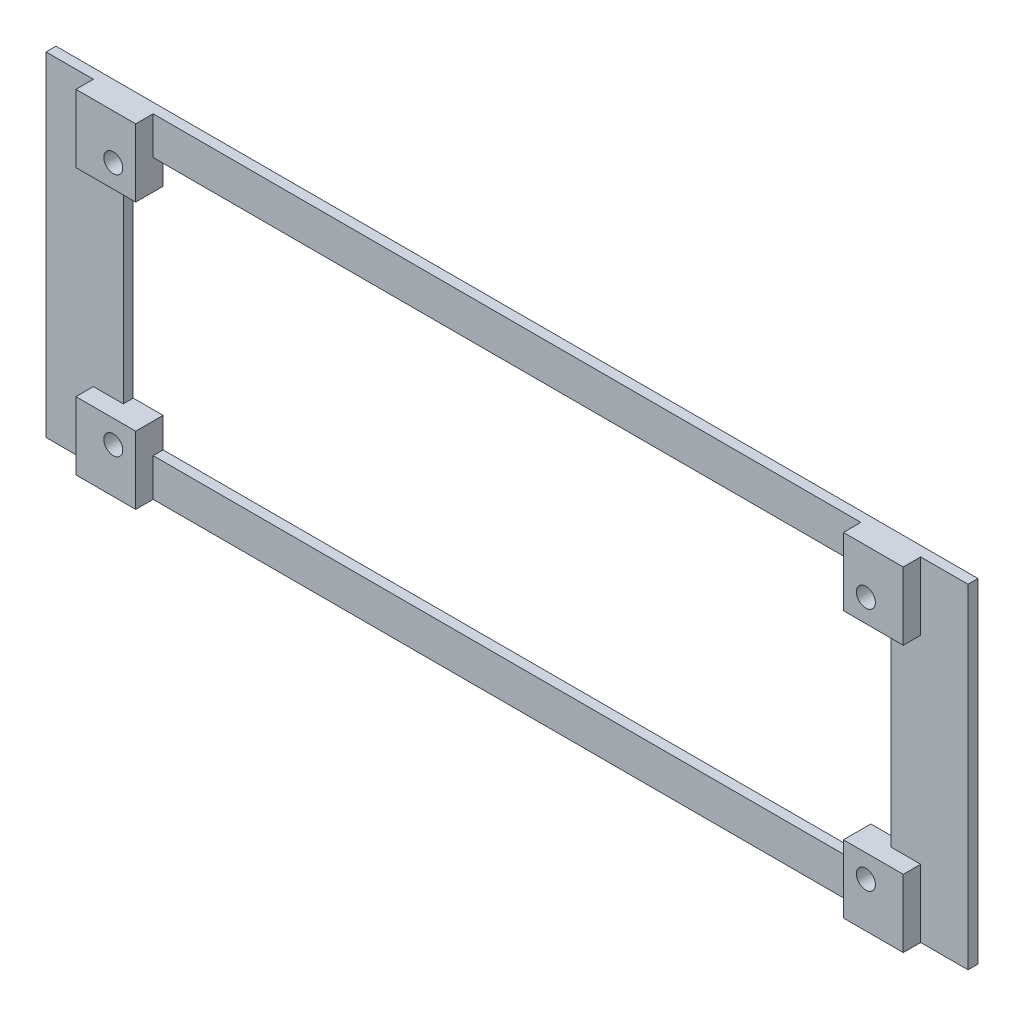
ISO-10303-21;
HEADER;
FILE_DESCRIPTION(('STEP AP214'),'2;1');
FILE_NAME('part.step','',(''),(''),'','','');
FILE_SCHEMA(('AUTOMOTIVE_DESIGN { 1 0 10303 214 1 1 1 1 }'));
ENDSEC;
DATA;
#1=APPLICATION_CONTEXT('core data for automotive mechanical design processes');
#2=APPLICATION_PROTOCOL_DEFINITION('international standard','automotive_design',2000,#1);
#3=PRODUCT_CONTEXT('',#1,'mechanical');
#4=PRODUCT('Part','Part','',(#3));
#5=PRODUCT_RELATED_PRODUCT_CATEGORY('part','',(#4));
#6=PRODUCT_DEFINITION_FORMATION('','',#4);
#7=PRODUCT_DEFINITION_CONTEXT('part definition',#1,'design');
#8=PRODUCT_DEFINITION('design','',#6,#7);
#9=PRODUCT_DEFINITION_SHAPE('','',#8);
#10=(LENGTH_UNIT() NAMED_UNIT(*) SI_UNIT(.MILLI.,.METRE.));
#11=(NAMED_UNIT(*) PLANE_ANGLE_UNIT() SI_UNIT($,.RADIAN.));
#12=(NAMED_UNIT(*) SI_UNIT($,.STERADIAN.) SOLID_ANGLE_UNIT());
#13=UNCERTAINTY_MEASURE_WITH_UNIT(LENGTH_MEASURE(1.E-05),#10,'distance_accuracy_value','');
#14=(GEOMETRIC_REPRESENTATION_CONTEXT(3) GLOBAL_UNCERTAINTY_ASSIGNED_CONTEXT((#13)) GLOBAL_UNIT_ASSIGNED_CONTEXT((#10,
#11,#12)) REPRESENTATION_CONTEXT('',''));
#15=CARTESIAN_POINT('',(0.,0.,0.));
#16=DIRECTION('',(0.,0.,1.));
#17=DIRECTION('',(1.,0.,0.));
#18=AXIS2_PLACEMENT_3D('',#15,#16,#17);
#19=CARTESIAN_POINT('',(0.,0.,2.));
#20=DIRECTION('',(0.,0.,1.));
#21=DIRECTION('',(1.,0.,0.));
#22=AXIS2_PLACEMENT_3D('',#19,#20,#21);
#23=PLANE('',#22);
#24=DIRECTION('',(0.,1.,0.));
#25=VECTOR('',#24,1.);
#26=CARTESIAN_POINT('',(71.,0.,2.));
#27=LINE('',#26,#25);
#28=CARTESIAN_POINT('',(71.,-33.5,2.));
#29=VERTEX_POINT('',#28);
#30=CARTESIAN_POINT('',(71.,-25.9,2.));
#31=VERTEX_POINT('',#30);
#32=EDGE_CURVE('E230',#29,#31,#27,.T.);
#33=ORIENTED_EDGE('',*,*,#32,.T.);
#34=DIRECTION('',(1.,0.,0.));
#35=VECTOR('',#34,1.);
#36=CARTESIAN_POINT('',(0.,-25.9,2.));
#37=LINE('',#36,#35);
#38=CARTESIAN_POINT('',(-71.,-25.9,2.));
#39=VERTEX_POINT('',#38);
#40=EDGE_CURVE('E347',#39,#31,#37,.T.);
#41=ORIENTED_EDGE('',*,*,#40,.F.);
#42=DIRECTION('',(0.,1.,0.));
#43=VECTOR('',#42,1.);
#44=CARTESIAN_POINT('',(-71.,0.,2.));
#45=LINE('',#44,#43);
#46=CARTESIAN_POINT('',(-71.,-33.5,2.));
#47=VERTEX_POINT('',#46);
#48=EDGE_CURVE('E289',#47,#39,#45,.T.);
#49=ORIENTED_EDGE('',*,*,#48,.F.);
#50=DIRECTION('',(1.,0.,0.));
#51=VECTOR('',#50,1.);
#52=CARTESIAN_POINT('',(0.,-33.5,2.));
#53=LINE('',#52,#51);
#54=EDGE_CURVE('E60',#47,#29,#53,.T.);
#55=ORIENTED_EDGE('',*,*,#54,.T.);
#56=EDGE_LOOP('',(#33,#41,#49,#55));
#57=FACE_BOUND('',#56,.T.);
#58=ADVANCED_FACE('F35',(#57),#23,.T.);
#59=DIRECTION('',(1.,0.,0.));
#60=VECTOR('',#59,1.);
#61=CARTESIAN_POINT('',(0.,25.9,2.));
#62=LINE('',#61,#60);
#63=CARTESIAN_POINT('',(-71.,25.9,2.));
#64=VERTEX_POINT('',#63);
#65=CARTESIAN_POINT('',(71.,25.9,2.));
#66=VERTEX_POINT('',#65);
#67=EDGE_CURVE('E342',#64,#66,#62,.T.);
#68=ORIENTED_EDGE('',*,*,#67,.T.);
#69=DIRECTION('',(0.,-1.,0.));
#70=VECTOR('',#69,1.);
#71=CARTESIAN_POINT('',(71.,0.,2.));
#72=LINE('',#71,#70);
#73=CARTESIAN_POINT('',(71.,33.5,2.));
#74=VERTEX_POINT('',#73);
#75=EDGE_CURVE('E232',#74,#66,#72,.T.);
#76=ORIENTED_EDGE('',*,*,#75,.F.);
#77=DIRECTION('',(1.,0.,0.));
#78=VECTOR('',#77,1.);
#79=CARTESIAN_POINT('',(0.,33.5,2.));
#80=LINE('',#79,#78);
#81=CARTESIAN_POINT('',(-71.,33.5,2.));
#82=VERTEX_POINT('',#81);
#83=EDGE_CURVE('E361',#82,#74,#80,.T.);
#84=ORIENTED_EDGE('',*,*,#83,.F.);
#85=DIRECTION('',(0.,1.,0.));
#86=VECTOR('',#85,1.);
#87=CARTESIAN_POINT('',(-71.,0.,2.));
#88=LINE('',#87,#86);
#89=EDGE_CURVE('E44',#64,#82,#88,.T.);
#90=ORIENTED_EDGE('',*,*,#89,.F.);
#91=EDGE_LOOP('',(#68,#76,#84,#90));
#92=FACE_BOUND('',#91,.T.);
#93=ADVANCED_FACE('F510',(#92),#23,.T.);
#94=DIRECTION('',(0.,-1.,0.));
#95=VECTOR('',#94,1.);
#96=CARTESIAN_POINT('',(82.9999999999999,0.,2.));
#97=LINE('',#96,#95);
#98=CARTESIAN_POINT('',(82.9999999999999,-19.9,2.));
#99=VERTEX_POINT('',#98);
#100=CARTESIAN_POINT('',(82.9999999999999,-33.5,2.));
#101=VERTEX_POINT('',#100);
#102=EDGE_CURVE('E249',#99,#101,#97,.T.);
#103=ORIENTED_EDGE('',*,*,#102,.T.);
#104=CARTESIAN_POINT('',(92.5,-33.5,2.));
#105=VERTEX_POINT('',#104);
#106=EDGE_CURVE('E364',#101,#105,#53,.T.);
#107=ORIENTED_EDGE('',*,*,#106,.T.);
#108=DIRECTION('',(0.,-1.,0.));
#109=VECTOR('',#108,1.);
#110=CARTESIAN_POINT('',(92.5,0.,2.));
#111=LINE('',#110,#109);
#112=CARTESIAN_POINT('',(92.5,33.5,2.));
#113=VERTEX_POINT('',#112);
#114=EDGE_CURVE('E353',#113,#105,#111,.T.);
#115=ORIENTED_EDGE('',*,*,#114,.F.);
#116=CARTESIAN_POINT('',(82.9999999999999,33.5,2.));
#117=VERTEX_POINT('',#116);
#118=EDGE_CURVE('E356',#117,#113,#80,.T.);
#119=ORIENTED_EDGE('',*,*,#118,.F.);
#120=DIRECTION('',(0.,1.,0.));
#121=VECTOR('',#120,1.);
#122=CARTESIAN_POINT('',(82.9999999999999,0.,2.));
#123=LINE('',#122,#121);
#124=CARTESIAN_POINT('',(82.9999999999999,19.9,2.));
#125=VERTEX_POINT('',#124);
#126=EDGE_CURVE('E266',#125,#117,#123,.T.);
#127=ORIENTED_EDGE('',*,*,#126,.F.);
#128=DIRECTION('',(1.,0.,0.));
#129=VECTOR('',#128,1.);
#130=CARTESIAN_POINT('',(0.,19.9,2.));
#131=LINE('',#130,#129);
#132=CARTESIAN_POINT('',(77.,19.9,2.));
#133=VERTEX_POINT('',#132);
#134=EDGE_CURVE('E276',#133,#125,#131,.T.);
#135=ORIENTED_EDGE('',*,*,#134,.F.);
#136=DIRECTION('',(0.,-1.,0.));
#137=VECTOR('',#136,1.);
#138=CARTESIAN_POINT('',(77.,0.,2.));
#139=LINE('',#138,#137);
#140=CARTESIAN_POINT('',(77.,-19.9,2.));
#141=VERTEX_POINT('',#140);
#142=EDGE_CURVE('E344',#133,#141,#139,.T.);
#143=ORIENTED_EDGE('',*,*,#142,.T.);
#144=DIRECTION('',(1.,0.,0.));
#145=VECTOR('',#144,1.);
#146=CARTESIAN_POINT('',(0.,-19.9,2.));
#147=LINE('',#146,#145);
#148=EDGE_CURVE('E52',#141,#99,#147,.T.);
#149=ORIENTED_EDGE('',*,*,#148,.T.);
#150=EDGE_LOOP('',(#103,#107,#115,#119,#127,#135,#143,#149));
#151=FACE_BOUND('',#150,.T.);
#152=ADVANCED_FACE('F535',(#151),#23,.T.);
#153=DIRECTION('',(0.,-1.,0.));
#154=VECTOR('',#153,1.);
#155=CARTESIAN_POINT('',(-82.9999999999999,0.,2.));
#156=LINE('',#155,#154);
#157=CARTESIAN_POINT('',(-82.9999999999999,-19.9,2.));
#158=VERTEX_POINT('',#157);
#159=CARTESIAN_POINT('',(-82.9999999999999,-33.5,2.));
#160=VERTEX_POINT('',#159);
#161=EDGE_CURVE('E294',#158,#160,#156,.T.);
#162=ORIENTED_EDGE('',*,*,#161,.F.);
#163=DIRECTION('',(-1.,0.,0.));
#164=VECTOR('',#163,1.);
#165=CARTESIAN_POINT('',(0.,-19.9,2.));
#166=LINE('',#165,#164);
#167=CARTESIAN_POINT('',(-77.,-19.9,2.));
#168=VERTEX_POINT('',#167);
#169=EDGE_CURVE('E304',#168,#158,#166,.T.);
#170=ORIENTED_EDGE('',*,*,#169,.F.);
#171=DIRECTION('',(0.,-1.,0.));
#172=VECTOR('',#171,1.);
#173=CARTESIAN_POINT('',(-77.,0.,2.));
#174=LINE('',#173,#172);
#175=CARTESIAN_POINT('',(-77.,19.9,2.));
#176=VERTEX_POINT('',#175);
#177=EDGE_CURVE('E350',#176,#168,#174,.T.);
#178=ORIENTED_EDGE('',*,*,#177,.F.);
#179=DIRECTION('',(-1.,0.,0.));
#180=VECTOR('',#179,1.);
#181=CARTESIAN_POINT('',(0.,19.9,2.));
#182=LINE('',#181,#180);
#183=CARTESIAN_POINT('',(-82.9999999999999,19.9,2.));
#184=VERTEX_POINT('',#183);
#185=EDGE_CURVE('E11',#176,#184,#182,.T.);
#186=ORIENTED_EDGE('',*,*,#185,.T.);
#187=DIRECTION('',(0.,1.,0.));
#188=VECTOR('',#187,1.);
#189=CARTESIAN_POINT('',(-82.9999999999999,0.,2.));
#190=LINE('',#189,#188);
#191=CARTESIAN_POINT('',(-82.9999999999999,33.5,2.));
#192=VERTEX_POINT('',#191);
#193=EDGE_CURVE('E317',#184,#192,#190,.T.);
#194=ORIENTED_EDGE('',*,*,#193,.T.);
#195=CARTESIAN_POINT('',(-92.5,33.5,2.));
#196=VERTEX_POINT('',#195);
#197=EDGE_CURVE('E357',#196,#192,#80,.T.);
#198=ORIENTED_EDGE('',*,*,#197,.F.);
#199=DIRECTION('',(0.,-1.,0.));
#200=VECTOR('',#199,1.);
#201=CARTESIAN_POINT('',(-92.5,0.,2.));
#202=LINE('',#201,#200);
#203=CARTESIAN_POINT('',(-92.5,-33.5,2.));
#204=VERTEX_POINT('',#203);
#205=EDGE_CURVE('E360',#196,#204,#202,.T.);
#206=ORIENTED_EDGE('',*,*,#205,.T.);
#207=EDGE_CURVE('E365',#204,#160,#53,.T.);
#208=ORIENTED_EDGE('',*,*,#207,.T.);
#209=EDGE_LOOP('',(#162,#170,#178,#186,#194,#198,#206,#208));
#210=FACE_BOUND('',#209,.T.);
#211=ADVANCED_FACE('F519',(#210),#23,.T.);
#212=CARTESIAN_POINT('',(92.5,0.,2.));
#213=DIRECTION('',(1.,0.,0.));
#214=DIRECTION('',(0.,0.,-1.));
#215=AXIS2_PLACEMENT_3D('',#212,#213,#214);
#216=PLANE('',#215);
#217=DIRECTION('',(0.,-1.,0.));
#218=VECTOR('',#217,1.);
#219=CARTESIAN_POINT('',(92.5,0.,0.));
#220=LINE('',#219,#218);
#221=CARTESIAN_POINT('',(92.5,33.5,0.));
#222=VERTEX_POINT('',#221);
#223=CARTESIAN_POINT('',(92.5,-33.5,0.));
#224=VERTEX_POINT('',#223);
#225=EDGE_CURVE('E399',#222,#224,#220,.T.);
#226=ORIENTED_EDGE('',*,*,#225,.F.);
#227=DIRECTION('',(0.,0.,-1.));
#228=VECTOR('',#227,1.);
#229=CARTESIAN_POINT('',(92.5,33.5,2.));
#230=LINE('',#229,#228);
#231=EDGE_CURVE('E331',#113,#222,#230,.T.);
#232=ORIENTED_EDGE('',*,*,#231,.F.);
#233=ORIENTED_EDGE('',*,*,#114,.T.);
#234=DIRECTION('',(0.,0.,-1.));
#235=VECTOR('',#234,1.);
#236=CARTESIAN_POINT('',(92.5,-33.5,2.));
#237=LINE('',#236,#235);
#238=EDGE_CURVE('E409',#105,#224,#237,.T.);
#239=ORIENTED_EDGE('',*,*,#238,.T.);
#240=EDGE_LOOP('',(#226,#232,#233,#239));
#241=FACE_BOUND('',#240,.T.);
#242=ADVANCED_FACE('F532',(#241),#216,.T.);
#243=CARTESIAN_POINT('',(0.,33.5,2.));
#244=DIRECTION('',(0.,1.,0.));
#245=DIRECTION('',(0.,0.,1.));
#246=AXIS2_PLACEMENT_3D('',#243,#244,#245);
#247=PLANE('',#246);
#248=DIRECTION('',(1.,0.,0.));
#249=VECTOR('',#248,1.);
#250=CARTESIAN_POINT('',(0.,33.5,0.));
#251=LINE('',#250,#249);
#252=CARTESIAN_POINT('',(-92.5,33.5,0.));
#253=VERTEX_POINT('',#252);
#254=EDGE_CURVE('E402',#253,#222,#251,.T.);
#255=ORIENTED_EDGE('',*,*,#254,.F.);
#256=DIRECTION('',(0.,0.,-1.));
#257=VECTOR('',#256,1.);
#258=CARTESIAN_POINT('',(-92.5,33.5,2.));
#259=LINE('',#258,#257);
#260=EDGE_CURVE('E414',#196,#253,#259,.T.);
#261=ORIENTED_EDGE('',*,*,#260,.F.);
#262=ORIENTED_EDGE('',*,*,#197,.T.);
#263=DIRECTION('',(0.,0.,-1.));
#264=VECTOR('',#263,1.);
#265=CARTESIAN_POINT('',(-82.9999999999999,33.5,5.5));
#266=LINE('',#265,#264);
#267=CARTESIAN_POINT('',(-82.9999999999999,33.5,5.5));
#268=VERTEX_POINT('',#267);
#269=EDGE_CURVE('E335',#268,#192,#266,.T.);
#270=ORIENTED_EDGE('',*,*,#269,.F.);
#271=DIRECTION('',(-1.,0.,0.));
#272=VECTOR('',#271,1.);
#273=CARTESIAN_POINT('',(0.,33.5,5.5));
#274=LINE('',#273,#272);
#275=CARTESIAN_POINT('',(-71.,33.5,5.5));
#276=VERTEX_POINT('',#275);
#277=EDGE_CURVE('E323',#276,#268,#274,.T.);
#278=ORIENTED_EDGE('',*,*,#277,.F.);
#279=DIRECTION('',(0.,0.,-1.));
#280=VECTOR('',#279,1.);
#281=CARTESIAN_POINT('',(-71.,33.5,5.5));
#282=LINE('',#281,#280);
#283=EDGE_CURVE('E338',#276,#82,#282,.T.);
#284=ORIENTED_EDGE('',*,*,#283,.T.);
#285=ORIENTED_EDGE('',*,*,#83,.T.);
#286=DIRECTION('',(0.,0.,-1.));
#287=VECTOR('',#286,1.);
#288=CARTESIAN_POINT('',(71.,33.5,5.5));
#289=LINE('',#288,#287);
#290=CARTESIAN_POINT('',(71.,33.5,5.5));
#291=VERTEX_POINT('',#290);
#292=EDGE_CURVE('E286',#291,#74,#289,.T.);
#293=ORIENTED_EDGE('',*,*,#292,.F.);
#294=DIRECTION('',(-1.,0.,0.));
#295=VECTOR('',#294,1.);
#296=CARTESIAN_POINT('',(0.,33.5,5.5));
#297=LINE('',#296,#295);
#298=CARTESIAN_POINT('',(82.9999999999999,33.5,5.5));
#299=VERTEX_POINT('',#298);
#300=EDGE_CURVE('E262',#299,#291,#297,.T.);
#301=ORIENTED_EDGE('',*,*,#300,.F.);
#302=DIRECTION('',(0.,0.,-1.));
#303=VECTOR('',#302,1.);
#304=CARTESIAN_POINT('',(82.9999999999999,33.5,5.5));
#305=LINE('',#304,#303);
#306=EDGE_CURVE('E273',#299,#117,#305,.T.);
#307=ORIENTED_EDGE('',*,*,#306,.T.);
#308=ORIENTED_EDGE('',*,*,#118,.T.);
#309=ORIENTED_EDGE('',*,*,#231,.T.);
#310=EDGE_LOOP('',(#255,#261,#262,#270,#278,#284,#285,#293,#301,#307,#308,#309));
#311=FACE_BOUND('',#310,.T.);
#312=ADVANCED_FACE('F508',(#311),#247,.T.);
#313=CARTESIAN_POINT('',(-92.5,0.,2.));
#314=DIRECTION('',(1.,0.,0.));
#315=DIRECTION('',(0.,0.,-1.));
#316=AXIS2_PLACEMENT_3D('',#313,#314,#315);
#317=PLANE('',#316);
#318=DIRECTION('',(0.,-1.,0.));
#319=VECTOR('',#318,1.);
#320=CARTESIAN_POINT('',(-92.5,0.,0.));
#321=LINE('',#320,#319);
#322=CARTESIAN_POINT('',(-92.5,-33.5,0.));
#323=VERTEX_POINT('',#322);
#324=EDGE_CURVE('E405',#253,#323,#321,.T.);
#325=ORIENTED_EDGE('',*,*,#324,.T.);
#326=DIRECTION('',(0.,0.,-1.));
#327=VECTOR('',#326,1.);
#328=CARTESIAN_POINT('',(-92.5,-33.5,2.));
#329=LINE('',#328,#327);
#330=EDGE_CURVE('E411',#204,#323,#329,.T.);
#331=ORIENTED_EDGE('',*,*,#330,.F.);
#332=ORIENTED_EDGE('',*,*,#205,.F.);
#333=ORIENTED_EDGE('',*,*,#260,.T.);
#334=EDGE_LOOP('',(#325,#331,#332,#333));
#335=FACE_BOUND('',#334,.T.);
#336=ADVANCED_FACE('F526',(#335),#317,.F.);
#337=CARTESIAN_POINT('',(-71.,0.,2.));
#338=DIRECTION('',(1.,0.,0.));
#339=DIRECTION('',(0.,0.,-1.));
#340=AXIS2_PLACEMENT_3D('',#337,#338,#339);
#341=PLANE('',#340);
#342=DIRECTION('',(0.,-1.,0.));
#343=VECTOR('',#342,1.);
#344=CARTESIAN_POINT('',(-71.,0.,0.));
#345=LINE('',#344,#343);
#346=CARTESIAN_POINT('',(-71.,25.9,0.));
#347=VERTEX_POINT('',#346);
#348=CARTESIAN_POINT('',(-71.,19.9,0.));
#349=VERTEX_POINT('',#348);
#350=EDGE_CURVE('E341',#347,#349,#345,.T.);
#351=ORIENTED_EDGE('',*,*,#350,.F.);
#352=DIRECTION('',(0.,0.,-1.));
#353=VECTOR('',#352,1.);
#354=CARTESIAN_POINT('',(-71.,25.9,2.));
#355=LINE('',#354,#353);
#356=EDGE_CURVE('E39',#64,#347,#355,.T.);
#357=ORIENTED_EDGE('',*,*,#356,.F.);
#358=ORIENTED_EDGE('',*,*,#89,.T.);
#359=ORIENTED_EDGE('',*,*,#283,.F.);
#360=DIRECTION('',(0.,1.,0.));
#361=VECTOR('',#360,1.);
#362=CARTESIAN_POINT('',(-71.,0.,5.5));
#363=LINE('',#362,#361);
#364=CARTESIAN_POINT('',(-71.,19.9,5.5));
#365=VERTEX_POINT('',#364);
#366=EDGE_CURVE('E321',#365,#276,#363,.T.);
#367=ORIENTED_EDGE('',*,*,#366,.F.);
#368=DIRECTION('',(0.,0.,-1.));
#369=VECTOR('',#368,1.);
#370=CARTESIAN_POINT('',(-71.,19.9,2.));
#371=LINE('',#370,#369);
#372=EDGE_CURVE('E367',#365,#349,#371,.T.);
#373=ORIENTED_EDGE('',*,*,#372,.T.);
#374=EDGE_LOOP('',(#351,#357,#358,#359,#367,#373));
#375=FACE_BOUND('',#374,.T.);
#376=ADVANCED_FACE('F37',(#375),#341,.T.);
#377=CARTESIAN_POINT('',(0.,25.9,2.));
#378=DIRECTION('',(0.,1.,0.));
#379=DIRECTION('',(0.,0.,1.));
#380=AXIS2_PLACEMENT_3D('',#377,#378,#379);
#381=PLANE('',#380);
#382=DIRECTION('',(1.,0.,0.));
#383=VECTOR('',#382,1.);
#384=CARTESIAN_POINT('',(0.,25.9,0.));
#385=LINE('',#384,#383);
#386=CARTESIAN_POINT('',(71.,25.9,0.));
#387=VERTEX_POINT('',#386);
#388=EDGE_CURVE('E370',#347,#387,#385,.T.);
#389=ORIENTED_EDGE('',*,*,#388,.T.);
#390=DIRECTION('',(0.,0.,-1.));
#391=VECTOR('',#390,1.);
#392=CARTESIAN_POINT('',(71.,25.9,2.));
#393=LINE('',#392,#391);
#394=EDGE_CURVE('E438',#66,#387,#393,.T.);
#395=ORIENTED_EDGE('',*,*,#394,.F.);
#396=ORIENTED_EDGE('',*,*,#67,.F.);
#397=ORIENTED_EDGE('',*,*,#356,.T.);
#398=EDGE_LOOP('',(#389,#395,#396,#397));
#399=FACE_BOUND('',#398,.T.);
#400=ADVANCED_FACE('F447',(#399),#381,.F.);
#401=CARTESIAN_POINT('',(71.,0.,2.));
#402=DIRECTION('',(1.,0.,0.));
#403=DIRECTION('',(0.,0.,-1.));
#404=AXIS2_PLACEMENT_3D('',#401,#402,#403);
#405=PLANE('',#404);
#406=DIRECTION('',(0.,-1.,0.));
#407=VECTOR('',#406,1.);
#408=CARTESIAN_POINT('',(71.,0.,0.));
#409=LINE('',#408,#407);
#410=CARTESIAN_POINT('',(71.,19.9,0.));
#411=VERTEX_POINT('',#410);
#412=EDGE_CURVE('E372',#387,#411,#409,.T.);
#413=ORIENTED_EDGE('',*,*,#412,.T.);
#414=DIRECTION('',(0.,0.,-1.));
#415=VECTOR('',#414,1.);
#416=CARTESIAN_POINT('',(71.,19.9,2.));
#417=LINE('',#416,#415);
#418=CARTESIAN_POINT('',(71.,19.9,5.5));
#419=VERTEX_POINT('',#418);
#420=EDGE_CURVE('E436',#419,#411,#417,.T.);
#421=ORIENTED_EDGE('',*,*,#420,.F.);
#422=DIRECTION('',(0.,-1.,0.));
#423=VECTOR('',#422,1.);
#424=CARTESIAN_POINT('',(71.,0.,5.5));
#425=LINE('',#424,#423);
#426=EDGE_CURVE('E265',#291,#419,#425,.T.);
#427=ORIENTED_EDGE('',*,*,#426,.F.);
#428=ORIENTED_EDGE('',*,*,#292,.T.);
#429=ORIENTED_EDGE('',*,*,#75,.T.);
#430=ORIENTED_EDGE('',*,*,#394,.T.);
#431=EDGE_LOOP('',(#413,#421,#427,#428,#429,#430));
#432=FACE_BOUND('',#431,.T.);
#433=ADVANCED_FACE('F498',(#432),#405,.F.);
#434=CARTESIAN_POINT('',(0.,19.9,2.));
#435=DIRECTION('',(0.,1.,0.));
#436=DIRECTION('',(0.,0.,1.));
#437=AXIS2_PLACEMENT_3D('',#434,#435,#436);
#438=PLANE('',#437);
#439=DIRECTION('',(1.,0.,0.));
#440=VECTOR('',#439,1.);
#441=CARTESIAN_POINT('',(0.,19.9,0.));
#442=LINE('',#441,#440);
#443=CARTESIAN_POINT('',(77.,19.9,0.));
#444=VERTEX_POINT('',#443);
#445=EDGE_CURVE('E374',#411,#444,#442,.T.);
#446=ORIENTED_EDGE('',*,*,#445,.T.);
#447=DIRECTION('',(0.,0.,-1.));
#448=VECTOR('',#447,1.);
#449=CARTESIAN_POINT('',(77.,19.9,2.));
#450=LINE('',#449,#448);
#451=EDGE_CURVE('E433',#133,#444,#450,.T.);
#452=ORIENTED_EDGE('',*,*,#451,.F.);
#453=ORIENTED_EDGE('',*,*,#134,.T.);
#454=DIRECTION('',(0.,0.,-1.));
#455=VECTOR('',#454,1.);
#456=CARTESIAN_POINT('',(82.9999999999999,19.9,5.5));
#457=LINE('',#456,#455);
#458=CARTESIAN_POINT('',(82.9999999999999,19.9,5.5));
#459=VERTEX_POINT('',#458);
#460=EDGE_CURVE('E283',#459,#125,#457,.T.);
#461=ORIENTED_EDGE('',*,*,#460,.F.);
#462=DIRECTION('',(1.,0.,0.));
#463=VECTOR('',#462,1.);
#464=CARTESIAN_POINT('',(0.,19.9,5.5));
#465=LINE('',#464,#463);
#466=EDGE_CURVE('E269',#419,#459,#465,.T.);
#467=ORIENTED_EDGE('',*,*,#466,.F.);
#468=ORIENTED_EDGE('',*,*,#420,.T.);
#469=EDGE_LOOP('',(#446,#452,#453,#461,#467,#468));
#470=FACE_BOUND('',#469,.T.);
#471=ADVANCED_FACE('F494',(#470),#438,.F.);
#472=CARTESIAN_POINT('',(77.,0.,2.));
#473=DIRECTION('',(1.,0.,0.));
#474=DIRECTION('',(0.,0.,-1.));
#475=AXIS2_PLACEMENT_3D('',#472,#473,#474);
#476=PLANE('',#475);
#477=DIRECTION('',(0.,-1.,0.));
#478=VECTOR('',#477,1.);
#479=CARTESIAN_POINT('',(77.,0.,0.));
#480=LINE('',#479,#478);
#481=CARTESIAN_POINT('',(77.,-19.9,0.));
#482=VERTEX_POINT('',#481);
#483=EDGE_CURVE('E376',#444,#482,#480,.T.);
#484=ORIENTED_EDGE('',*,*,#483,.T.);
#485=DIRECTION('',(0.,0.,-1.));
#486=VECTOR('',#485,1.);
#487=CARTESIAN_POINT('',(77.,-19.9,2.));
#488=LINE('',#487,#486);
#489=EDGE_CURVE('E431',#141,#482,#488,.T.);
#490=ORIENTED_EDGE('',*,*,#489,.F.);
#491=ORIENTED_EDGE('',*,*,#142,.F.);
#492=ORIENTED_EDGE('',*,*,#451,.T.);
#493=EDGE_LOOP('',(#484,#490,#491,#492));
#494=FACE_BOUND('',#493,.T.);
#495=ADVANCED_FACE('F491',(#494),#476,.F.);
#496=CARTESIAN_POINT('',(0.,-19.9,2.));
#497=DIRECTION('',(0.,1.,0.));
#498=DIRECTION('',(0.,0.,1.));
#499=AXIS2_PLACEMENT_3D('',#496,#497,#498);
#500=PLANE('',#499);
#501=DIRECTION('',(1.,0.,0.));
#502=VECTOR('',#501,1.);
#503=CARTESIAN_POINT('',(0.,-19.9,0.));
#504=LINE('',#503,#502);
#505=CARTESIAN_POINT('',(71.,-19.9,0.));
#506=VERTEX_POINT('',#505);
#507=EDGE_CURVE('E379',#506,#482,#504,.T.);
#508=ORIENTED_EDGE('',*,*,#507,.F.);
#509=DIRECTION('',(0.,0.,-1.));
#510=VECTOR('',#509,1.);
#511=CARTESIAN_POINT('',(71.,-19.9,2.));
#512=LINE('',#511,#510);
#513=CARTESIAN_POINT('',(71.,-19.9,5.5));
#514=VERTEX_POINT('',#513);
#515=EDGE_CURVE('E429',#514,#506,#512,.T.);
#516=ORIENTED_EDGE('',*,*,#515,.F.);
#517=DIRECTION('',(1.,0.,0.));
#518=VECTOR('',#517,1.);
#519=CARTESIAN_POINT('',(0.,-19.9,5.5));
#520=LINE('',#519,#518);
#521=CARTESIAN_POINT('',(82.9999999999999,-19.9,5.5));
#522=VERTEX_POINT('',#521);
#523=EDGE_CURVE('E247',#514,#522,#520,.T.);
#524=ORIENTED_EDGE('',*,*,#523,.T.);
#525=DIRECTION('',(0.,0.,-1.));
#526=VECTOR('',#525,1.);
#527=CARTESIAN_POINT('',(82.9999999999999,-19.9,5.5));
#528=LINE('',#527,#526);
#529=EDGE_CURVE('E257',#522,#99,#528,.T.);
#530=ORIENTED_EDGE('',*,*,#529,.T.);
#531=ORIENTED_EDGE('',*,*,#148,.F.);
#532=ORIENTED_EDGE('',*,*,#489,.T.);
#533=EDGE_LOOP('',(#508,#516,#524,#530,#531,#532));
#534=FACE_BOUND('',#533,.T.);
#535=ADVANCED_FACE('F488',(#534),#500,.T.);
#536=CARTESIAN_POINT('',(71.,0.,2.));
#537=DIRECTION('',(-1.,0.,0.));
#538=DIRECTION('',(0.,0.,1.));
#539=AXIS2_PLACEMENT_3D('',#536,#537,#538);
#540=PLANE('',#539);
#541=DIRECTION('',(0.,1.,0.));
#542=VECTOR('',#541,1.);
#543=CARTESIAN_POINT('',(71.,0.,0.));
#544=LINE('',#543,#542);
#545=CARTESIAN_POINT('',(71.,-25.9,0.));
#546=VERTEX_POINT('',#545);
#547=EDGE_CURVE('E382',#546,#506,#544,.T.);
#548=ORIENTED_EDGE('',*,*,#547,.F.);
#549=DIRECTION('',(0.,0.,-1.));
#550=VECTOR('',#549,1.);
#551=CARTESIAN_POINT('',(71.,-25.9,2.));
#552=LINE('',#551,#550);
#553=EDGE_CURVE('E427',#31,#546,#552,.T.);
#554=ORIENTED_EDGE('',*,*,#553,.F.);
#555=ORIENTED_EDGE('',*,*,#32,.F.);
#556=DIRECTION('',(0.,0.,-1.));
#557=VECTOR('',#556,1.);
#558=CARTESIAN_POINT('',(71.,-33.5,5.5));
#559=LINE('',#558,#557);
#560=CARTESIAN_POINT('',(71.,-33.5,5.5));
#561=VERTEX_POINT('',#560);
#562=EDGE_CURVE('E222',#561,#29,#559,.T.);
#563=ORIENTED_EDGE('',*,*,#562,.F.);
#564=DIRECTION('',(0.,1.,0.));
#565=VECTOR('',#564,1.);
#566=CARTESIAN_POINT('',(71.,0.,5.5));
#567=LINE('',#566,#565);
#568=EDGE_CURVE('E227',#561,#514,#567,.T.);
#569=ORIENTED_EDGE('',*,*,#568,.T.);
#570=ORIENTED_EDGE('',*,*,#515,.T.);
#571=EDGE_LOOP('',(#548,#554,#555,#563,#569,#570));
#572=FACE_BOUND('',#571,.T.);
#573=ADVANCED_FACE('F225',(#572),#540,.T.);
#574=CARTESIAN_POINT('',(0.,-25.9,2.));
#575=DIRECTION('',(0.,1.,0.));
#576=DIRECTION('',(0.,0.,1.));
#577=AXIS2_PLACEMENT_3D('',#574,#575,#576);
#578=PLANE('',#577);
#579=DIRECTION('',(1.,0.,0.));
#580=VECTOR('',#579,1.);
#581=CARTESIAN_POINT('',(0.,-25.9,0.));
#582=LINE('',#581,#580);
#583=CARTESIAN_POINT('',(-71.,-25.9,0.));
#584=VERTEX_POINT('',#583);
#585=EDGE_CURVE('E385',#584,#546,#582,.T.);
#586=ORIENTED_EDGE('',*,*,#585,.F.);
#587=DIRECTION('',(0.,0.,-1.));
#588=VECTOR('',#587,1.);
#589=CARTESIAN_POINT('',(-71.,-25.9,2.));
#590=LINE('',#589,#588);
#591=EDGE_CURVE('E425',#39,#584,#590,.T.);
#592=ORIENTED_EDGE('',*,*,#591,.F.);
#593=ORIENTED_EDGE('',*,*,#40,.T.);
#594=ORIENTED_EDGE('',*,*,#553,.T.);
#595=EDGE_LOOP('',(#586,#592,#593,#594));
#596=FACE_BOUND('',#595,.T.);
#597=ADVANCED_FACE('F484',(#596),#578,.T.);
#598=CARTESIAN_POINT('',(-71.,0.,2.));
#599=DIRECTION('',(-1.,0.,0.));
#600=DIRECTION('',(0.,0.,1.));
#601=AXIS2_PLACEMENT_3D('',#598,#599,#600);
#602=PLANE('',#601);
#603=DIRECTION('',(0.,1.,0.));
#604=VECTOR('',#603,1.);
#605=CARTESIAN_POINT('',(-71.,0.,0.));
#606=LINE('',#605,#604);
#607=CARTESIAN_POINT('',(-71.,-19.9,0.));
#608=VERTEX_POINT('',#607);
#609=EDGE_CURVE('E388',#584,#608,#606,.T.);
#610=ORIENTED_EDGE('',*,*,#609,.T.);
#611=DIRECTION('',(0.,0.,-1.));
#612=VECTOR('',#611,1.);
#613=CARTESIAN_POINT('',(-71.,-19.9,2.));
#614=LINE('',#613,#612);
#615=CARTESIAN_POINT('',(-71.,-19.9,5.5));
#616=VERTEX_POINT('',#615);
#617=EDGE_CURVE('E422',#616,#608,#614,.T.);
#618=ORIENTED_EDGE('',*,*,#617,.F.);
#619=DIRECTION('',(0.,1.,0.));
#620=VECTOR('',#619,1.);
#621=CARTESIAN_POINT('',(-71.,0.,5.5));
#622=LINE('',#621,#620);
#623=CARTESIAN_POINT('',(-71.,-33.5,5.5));
#624=VERTEX_POINT('',#623);
#625=EDGE_CURVE('E293',#624,#616,#622,.T.);
#626=ORIENTED_EDGE('',*,*,#625,.F.);
#627=DIRECTION('',(0.,0.,-1.));
#628=VECTOR('',#627,1.);
#629=CARTESIAN_POINT('',(-71.,-33.5,5.5));
#630=LINE('',#629,#628);
#631=EDGE_CURVE('E314',#624,#47,#630,.T.);
#632=ORIENTED_EDGE('',*,*,#631,.T.);
#633=ORIENTED_EDGE('',*,*,#48,.T.);
#634=ORIENTED_EDGE('',*,*,#591,.T.);
#635=EDGE_LOOP('',(#610,#618,#626,#632,#633,#634));
#636=FACE_BOUND('',#635,.T.);
#637=ADVANCED_FACE('F474',(#636),#602,.F.);
#638=CARTESIAN_POINT('',(0.,-19.9,2.));
#639=DIRECTION('',(0.,-1.,0.));
#640=DIRECTION('',(0.,0.,-1.));
#641=AXIS2_PLACEMENT_3D('',#638,#639,#640);
#642=PLANE('',#641);
#643=DIRECTION('',(-1.,0.,0.));
#644=VECTOR('',#643,1.);
#645=CARTESIAN_POINT('',(0.,-19.9,0.));
#646=LINE('',#645,#644);
#647=CARTESIAN_POINT('',(-77.,-19.9,0.));
#648=VERTEX_POINT('',#647);
#649=EDGE_CURVE('E390',#608,#648,#646,.T.);
#650=ORIENTED_EDGE('',*,*,#649,.T.);
#651=DIRECTION('',(0.,0.,-1.));
#652=VECTOR('',#651,1.);
#653=CARTESIAN_POINT('',(-77.,-19.9,2.));
#654=LINE('',#653,#652);
#655=EDGE_CURVE('E420',#168,#648,#654,.T.);
#656=ORIENTED_EDGE('',*,*,#655,.F.);
#657=ORIENTED_EDGE('',*,*,#169,.T.);
#658=DIRECTION('',(0.,0.,-1.));
#659=VECTOR('',#658,1.);
#660=CARTESIAN_POINT('',(-82.9999999999999,-19.9,5.5));
#661=LINE('',#660,#659);
#662=CARTESIAN_POINT('',(-82.9999999999999,-19.9,5.5));
#663=VERTEX_POINT('',#662);
#664=EDGE_CURVE('E311',#663,#158,#661,.T.);
#665=ORIENTED_EDGE('',*,*,#664,.F.);
#666=DIRECTION('',(-1.,0.,0.));
#667=VECTOR('',#666,1.);
#668=CARTESIAN_POINT('',(0.,-19.9,5.5));
#669=LINE('',#668,#667);
#670=EDGE_CURVE('E297',#616,#663,#669,.T.);
#671=ORIENTED_EDGE('',*,*,#670,.F.);
#672=ORIENTED_EDGE('',*,*,#617,.T.);
#673=EDGE_LOOP('',(#650,#656,#657,#665,#671,#672));
#674=FACE_BOUND('',#673,.T.);
#675=ADVANCED_FACE('F470',(#674),#642,.F.);
#676=CARTESIAN_POINT('',(-77.,0.,2.));
#677=DIRECTION('',(1.,0.,0.));
#678=DIRECTION('',(0.,0.,-1.));
#679=AXIS2_PLACEMENT_3D('',#676,#677,#678);
#680=PLANE('',#679);
#681=DIRECTION('',(0.,-1.,0.));
#682=VECTOR('',#681,1.);
#683=CARTESIAN_POINT('',(-77.,0.,0.));
#684=LINE('',#683,#682);
#685=CARTESIAN_POINT('',(-77.,19.9,0.));
#686=VERTEX_POINT('',#685);
#687=EDGE_CURVE('E393',#686,#648,#684,.T.);
#688=ORIENTED_EDGE('',*,*,#687,.F.);
#689=DIRECTION('',(0.,0.,-1.));
#690=VECTOR('',#689,1.);
#691=CARTESIAN_POINT('',(-77.,19.9,2.));
#692=LINE('',#691,#690);
#693=EDGE_CURVE('E418',#176,#686,#692,.T.);
#694=ORIENTED_EDGE('',*,*,#693,.F.);
#695=ORIENTED_EDGE('',*,*,#177,.T.);
#696=ORIENTED_EDGE('',*,*,#655,.T.);
#697=EDGE_LOOP('',(#688,#694,#695,#696));
#698=FACE_BOUND('',#697,.T.);
#699=ADVANCED_FACE('F466',(#698),#680,.T.);
#700=CARTESIAN_POINT('',(0.,19.9,2.));
#701=DIRECTION('',(0.,-1.,0.));
#702=DIRECTION('',(0.,0.,-1.));
#703=AXIS2_PLACEMENT_3D('',#700,#701,#702);
#704=PLANE('',#703);
#705=DIRECTION('',(-1.,0.,0.));
#706=VECTOR('',#705,1.);
#707=CARTESIAN_POINT('',(0.,19.9,0.));
#708=LINE('',#707,#706);
#709=EDGE_CURVE('E396',#349,#686,#708,.T.);
#710=ORIENTED_EDGE('',*,*,#709,.F.);
#711=ORIENTED_EDGE('',*,*,#372,.F.);
#712=DIRECTION('',(-1.,0.,0.));
#713=VECTOR('',#712,1.);
#714=CARTESIAN_POINT('',(0.,19.9,5.5));
#715=LINE('',#714,#713);
#716=CARTESIAN_POINT('',(-82.9999999999999,19.9,5.5));
#717=VERTEX_POINT('',#716);
#718=EDGE_CURVE('E318',#365,#717,#715,.T.);
#719=ORIENTED_EDGE('',*,*,#718,.T.);
#720=DIRECTION('',(0.,0.,-1.));
#721=VECTOR('',#720,1.);
#722=CARTESIAN_POINT('',(-82.9999999999999,19.9,5.5));
#723=LINE('',#722,#721);
#724=EDGE_CURVE('E327',#717,#184,#723,.T.);
#725=ORIENTED_EDGE('',*,*,#724,.T.);
#726=ORIENTED_EDGE('',*,*,#185,.F.);
#727=ORIENTED_EDGE('',*,*,#693,.T.);
#728=EDGE_LOOP('',(#710,#711,#719,#725,#726,#727));
#729=FACE_BOUND('',#728,.T.);
#730=ADVANCED_FACE('F459',(#729),#704,.T.);
#731=CARTESIAN_POINT('',(0.,-33.5,2.));
#732=DIRECTION('',(0.,1.,0.));
#733=DIRECTION('',(0.,0.,1.));
#734=AXIS2_PLACEMENT_3D('',#731,#732,#733);
#735=PLANE('',#734);
#736=DIRECTION('',(1.,0.,0.));
#737=VECTOR('',#736,1.);
#738=CARTESIAN_POINT('',(0.,-33.5,0.));
#739=LINE('',#738,#737);
#740=EDGE_CURVE('E345',#323,#224,#739,.T.);
#741=ORIENTED_EDGE('',*,*,#740,.T.);
#742=ORIENTED_EDGE('',*,*,#238,.F.);
#743=ORIENTED_EDGE('',*,*,#106,.F.);
#744=DIRECTION('',(0.,0.,-1.));
#745=VECTOR('',#744,1.);
#746=CARTESIAN_POINT('',(82.9999999999999,-33.5,5.5));
#747=LINE('',#746,#745);
#748=CARTESIAN_POINT('',(82.9999999999999,-33.5,5.5));
#749=VERTEX_POINT('',#748);
#750=EDGE_CURVE('E233',#749,#101,#747,.T.);
#751=ORIENTED_EDGE('',*,*,#750,.F.);
#752=DIRECTION('',(1.,0.,0.));
#753=VECTOR('',#752,1.);
#754=CARTESIAN_POINT('',(0.,-33.5,5.5));
#755=LINE('',#754,#753);
#756=EDGE_CURVE('E236',#561,#749,#755,.T.);
#757=ORIENTED_EDGE('',*,*,#756,.F.);
#758=ORIENTED_EDGE('',*,*,#562,.T.);
#759=ORIENTED_EDGE('',*,*,#54,.F.);
#760=ORIENTED_EDGE('',*,*,#631,.F.);
#761=DIRECTION('',(1.,0.,0.));
#762=VECTOR('',#761,1.);
#763=CARTESIAN_POINT('',(0.,-33.5,5.5));
#764=LINE('',#763,#762);
#765=CARTESIAN_POINT('',(-82.9999999999999,-33.5,5.5));
#766=VERTEX_POINT('',#765);
#767=EDGE_CURVE('E290',#766,#624,#764,.T.);
#768=ORIENTED_EDGE('',*,*,#767,.F.);
#769=DIRECTION('',(0.,0.,-1.));
#770=VECTOR('',#769,1.);
#771=CARTESIAN_POINT('',(-82.9999999999999,-33.5,5.5));
#772=LINE('',#771,#770);
#773=EDGE_CURVE('E301',#766,#160,#772,.T.);
#774=ORIENTED_EDGE('',*,*,#773,.T.);
#775=ORIENTED_EDGE('',*,*,#207,.F.);
#776=ORIENTED_EDGE('',*,*,#330,.T.);
#777=EDGE_LOOP('',(#741,#742,#743,#751,#757,#758,#759,#760,#768,#774,#775,#776));
#778=FACE_BOUND('',#777,.T.);
#779=ADVANCED_FACE('F238',(#778),#735,.F.);
#780=CARTESIAN_POINT('',(0.,0.,0.));
#781=DIRECTION('',(0.,0.,1.));
#782=DIRECTION('',(1.,0.,0.));
#783=AXIS2_PLACEMENT_3D('',#780,#781,#782);
#784=PLANE('',#783);
#785=CARTESIAN_POINT('',(75.5,-24.5,0.));
#786=DIRECTION('',(0.,0.,1.));
#787=DIRECTION('',(1.,0.,0.));
#788=AXIS2_PLACEMENT_3D('',#785,#786,#787);
#789=CIRCLE('',#788,1.69999999999999);
#790=CARTESIAN_POINT('',(77.2,-24.5,0.));
#791=VERTEX_POINT('',#790);
#792=EDGE_CURVE('E612',#791,#791,#789,.T.);
#793=ORIENTED_EDGE('',*,*,#792,.T.);
#794=EDGE_LOOP('',(#793));
#795=FACE_BOUND('',#794,.T.);
#796=CARTESIAN_POINT('',(75.5,24.5,0.));
#797=DIRECTION('',(0.,0.,1.));
#798=DIRECTION('',(1.,0.,0.));
#799=AXIS2_PLACEMENT_3D('',#796,#797,#798);
#800=CIRCLE('',#799,1.69999999999999);
#801=CARTESIAN_POINT('',(77.2,24.5,0.));
#802=VERTEX_POINT('',#801);
#803=EDGE_CURVE('E616',#802,#802,#800,.T.);
#804=ORIENTED_EDGE('',*,*,#803,.T.);
#805=EDGE_LOOP('',(#804));
#806=FACE_BOUND('',#805,.T.);
#807=CARTESIAN_POINT('',(-75.5,24.5,0.));
#808=DIRECTION('',(0.,0.,1.));
#809=DIRECTION('',(1.,0.,0.));
#810=AXIS2_PLACEMENT_3D('',#807,#808,#809);
#811=CIRCLE('',#810,1.69999999999999);
#812=CARTESIAN_POINT('',(-73.8,24.5,0.));
#813=VERTEX_POINT('',#812);
#814=EDGE_CURVE('E620',#813,#813,#811,.T.);
#815=ORIENTED_EDGE('',*,*,#814,.T.);
#816=EDGE_LOOP('',(#815));
#817=FACE_BOUND('',#816,.T.);
#818=CARTESIAN_POINT('',(-75.5,-24.5,0.));
#819=DIRECTION('',(0.,0.,1.));
#820=DIRECTION('',(1.,0.,0.));
#821=AXIS2_PLACEMENT_3D('',#818,#819,#820);
#822=CIRCLE('',#821,1.69999999999999);
#823=CARTESIAN_POINT('',(-73.8,-24.5,0.));
#824=VERTEX_POINT('',#823);
#825=EDGE_CURVE('E252',#824,#824,#822,.T.);
#826=ORIENTED_EDGE('',*,*,#825,.T.);
#827=EDGE_LOOP('',(#826));
#828=FACE_BOUND('',#827,.T.);
#829=ORIENTED_EDGE('',*,*,#350,.T.);
#830=ORIENTED_EDGE('',*,*,#709,.T.);
#831=ORIENTED_EDGE('',*,*,#687,.T.);
#832=ORIENTED_EDGE('',*,*,#649,.F.);
#833=ORIENTED_EDGE('',*,*,#609,.F.);
#834=ORIENTED_EDGE('',*,*,#585,.T.);
#835=ORIENTED_EDGE('',*,*,#547,.T.);
#836=ORIENTED_EDGE('',*,*,#507,.T.);
#837=ORIENTED_EDGE('',*,*,#483,.F.);
#838=ORIENTED_EDGE('',*,*,#445,.F.);
#839=ORIENTED_EDGE('',*,*,#412,.F.);
#840=ORIENTED_EDGE('',*,*,#388,.F.);
#841=EDGE_LOOP('',(#829,#830,#831,#832,#833,#834,#835,#836,#837,#838,#839,#840));
#842=FACE_BOUND('',#841,.T.);
#843=ORIENTED_EDGE('',*,*,#225,.T.);
#844=ORIENTED_EDGE('',*,*,#740,.F.);
#845=ORIENTED_EDGE('',*,*,#324,.F.);
#846=ORIENTED_EDGE('',*,*,#254,.T.);
#847=EDGE_LOOP('',(#843,#844,#845,#846));
#848=FACE_BOUND('',#847,.T.);
#849=ADVANCED_FACE('F451',(#795,#806,#817,#828,#842,#848),#784,.F.);
#850=CARTESIAN_POINT('',(-82.9999999999999,0.,5.5));
#851=DIRECTION('',(-1.,0.,0.));
#852=DIRECTION('',(0.,0.,1.));
#853=AXIS2_PLACEMENT_3D('',#850,#851,#852);
#854=PLANE('',#853);
#855=ORIENTED_EDGE('',*,*,#193,.F.);
#856=ORIENTED_EDGE('',*,*,#724,.F.);
#857=DIRECTION('',(0.,1.,0.));
#858=VECTOR('',#857,1.);
#859=CARTESIAN_POINT('',(-82.9999999999999,0.,5.5));
#860=LINE('',#859,#858);
#861=EDGE_CURVE('E325',#717,#268,#860,.T.);
#862=ORIENTED_EDGE('',*,*,#861,.T.);
#863=ORIENTED_EDGE('',*,*,#269,.T.);
#864=EDGE_LOOP('',(#855,#856,#862,#863));
#865=FACE_BOUND('',#864,.T.);
#866=ADVANCED_FACE('F517',(#865),#854,.T.);
#867=CARTESIAN_POINT('',(0.,0.,5.5));
#868=DIRECTION('',(0.,0.,1.));
#869=DIRECTION('',(1.,0.,0.));
#870=AXIS2_PLACEMENT_3D('',#867,#868,#869);
#871=PLANE('',#870);
#872=CARTESIAN_POINT('',(-75.5,24.5,5.5));
#873=DIRECTION('',(0.,0.,1.));
#874=DIRECTION('',(1.,0.,0.));
#875=AXIS2_PLACEMENT_3D('',#872,#873,#874);
#876=CIRCLE('',#875,1.9);
#877=CARTESIAN_POINT('',(-73.6,24.5,5.5));
#878=VERTEX_POINT('',#877);
#879=EDGE_CURVE('E642',#878,#878,#876,.T.);
#880=ORIENTED_EDGE('',*,*,#879,.F.);
#881=EDGE_LOOP('',(#880));
#882=FACE_BOUND('',#881,.T.);
#883=ORIENTED_EDGE('',*,*,#718,.F.);
#884=ORIENTED_EDGE('',*,*,#366,.T.);
#885=ORIENTED_EDGE('',*,*,#277,.T.);
#886=ORIENTED_EDGE('',*,*,#861,.F.);
#887=EDGE_LOOP('',(#883,#884,#885,#886));
#888=FACE_BOUND('',#887,.T.);
#889=ADVANCED_FACE('F514',(#882,#888),#871,.T.);
#890=CARTESIAN_POINT('',(-82.9999999999999,0.,5.5));
#891=DIRECTION('',(1.,0.,0.));
#892=DIRECTION('',(0.,0.,-1.));
#893=AXIS2_PLACEMENT_3D('',#890,#891,#892);
#894=PLANE('',#893);
#895=ORIENTED_EDGE('',*,*,#161,.T.);
#896=ORIENTED_EDGE('',*,*,#773,.F.);
#897=DIRECTION('',(0.,-1.,0.));
#898=VECTOR('',#897,1.);
#899=CARTESIAN_POINT('',(-82.9999999999999,0.,5.5));
#900=LINE('',#899,#898);
#901=EDGE_CURVE('E299',#663,#766,#900,.T.);
#902=ORIENTED_EDGE('',*,*,#901,.F.);
#903=ORIENTED_EDGE('',*,*,#664,.T.);
#904=EDGE_LOOP('',(#895,#896,#902,#903));
#905=FACE_BOUND('',#904,.T.);
#906=ADVANCED_FACE('F522',(#905),#894,.F.);
#907=CARTESIAN_POINT('',(0.,0.,5.5));
#908=DIRECTION('',(0.,0.,1.));
#909=DIRECTION('',(1.,0.,0.));
#910=AXIS2_PLACEMENT_3D('',#907,#908,#909);
#911=PLANE('',#910);
#912=CARTESIAN_POINT('',(-75.5,-24.5,5.5));
#913=DIRECTION('',(0.,0.,1.));
#914=DIRECTION('',(1.,0.,0.));
#915=AXIS2_PLACEMENT_3D('',#912,#913,#914);
#916=CIRCLE('',#915,1.9);
#917=CARTESIAN_POINT('',(-73.6,-24.5,5.5));
#918=VERTEX_POINT('',#917);
#919=EDGE_CURVE('E630',#918,#918,#916,.T.);
#920=ORIENTED_EDGE('',*,*,#919,.F.);
#921=EDGE_LOOP('',(#920));
#922=FACE_BOUND('',#921,.T.);
#923=ORIENTED_EDGE('',*,*,#767,.T.);
#924=ORIENTED_EDGE('',*,*,#625,.T.);
#925=ORIENTED_EDGE('',*,*,#670,.T.);
#926=ORIENTED_EDGE('',*,*,#901,.T.);
#927=EDGE_LOOP('',(#923,#924,#925,#926));
#928=FACE_BOUND('',#927,.T.);
#929=ADVANCED_FACE('F476',(#922,#928),#911,.T.);
#930=CARTESIAN_POINT('',(82.9999999999999,0.,5.5));
#931=DIRECTION('',(-1.,0.,0.));
#932=DIRECTION('',(0.,0.,1.));
#933=AXIS2_PLACEMENT_3D('',#930,#931,#932);
#934=PLANE('',#933);
#935=ORIENTED_EDGE('',*,*,#126,.T.);
#936=ORIENTED_EDGE('',*,*,#306,.F.);
#937=DIRECTION('',(0.,1.,0.));
#938=VECTOR('',#937,1.);
#939=CARTESIAN_POINT('',(82.9999999999999,0.,5.5));
#940=LINE('',#939,#938);
#941=EDGE_CURVE('E271',#459,#299,#940,.T.);
#942=ORIENTED_EDGE('',*,*,#941,.F.);
#943=ORIENTED_EDGE('',*,*,#460,.T.);
#944=EDGE_LOOP('',(#935,#936,#942,#943));
#945=FACE_BOUND('',#944,.T.);
#946=ADVANCED_FACE('F549',(#945),#934,.F.);
#947=CARTESIAN_POINT('',(0.,0.,5.5));
#948=DIRECTION('',(0.,0.,1.));
#949=DIRECTION('',(1.,0.,0.));
#950=AXIS2_PLACEMENT_3D('',#947,#948,#949);
#951=PLANE('',#950);
#952=CARTESIAN_POINT('',(75.5,24.5,5.5));
#953=DIRECTION('',(0.,0.,1.));
#954=DIRECTION('',(1.,0.,0.));
#955=AXIS2_PLACEMENT_3D('',#952,#953,#954);
#956=CIRCLE('',#955,1.9);
#957=CARTESIAN_POINT('',(77.4,24.5,5.5));
#958=VERTEX_POINT('',#957);
#959=EDGE_CURVE('E652',#958,#958,#956,.T.);
#960=ORIENTED_EDGE('',*,*,#959,.F.);
#961=EDGE_LOOP('',(#960));
#962=FACE_BOUND('',#961,.T.);
#963=ORIENTED_EDGE('',*,*,#300,.T.);
#964=ORIENTED_EDGE('',*,*,#426,.T.);
#965=ORIENTED_EDGE('',*,*,#466,.T.);
#966=ORIENTED_EDGE('',*,*,#941,.T.);
#967=EDGE_LOOP('',(#963,#964,#965,#966));
#968=FACE_BOUND('',#967,.T.);
#969=ADVANCED_FACE('F500',(#962,#968),#951,.T.);
#970=CARTESIAN_POINT('',(82.9999999999999,0.,5.5));
#971=DIRECTION('',(1.,0.,0.));
#972=DIRECTION('',(0.,0.,-1.));
#973=AXIS2_PLACEMENT_3D('',#970,#971,#972);
#974=PLANE('',#973);
#975=ORIENTED_EDGE('',*,*,#102,.F.);
#976=ORIENTED_EDGE('',*,*,#529,.F.);
#977=DIRECTION('',(0.,-1.,0.));
#978=VECTOR('',#977,1.);
#979=CARTESIAN_POINT('',(82.9999999999999,0.,5.5));
#980=LINE('',#979,#978);
#981=EDGE_CURVE('E243',#522,#749,#980,.T.);
#982=ORIENTED_EDGE('',*,*,#981,.T.);
#983=ORIENTED_EDGE('',*,*,#750,.T.);
#984=EDGE_LOOP('',(#975,#976,#982,#983));
#985=FACE_BOUND('',#984,.T.);
#986=ADVANCED_FACE('F537',(#985),#974,.T.);
#987=CARTESIAN_POINT('',(0.,0.,5.5));
#988=DIRECTION('',(0.,0.,1.));
#989=DIRECTION('',(1.,0.,0.));
#990=AXIS2_PLACEMENT_3D('',#987,#988,#989);
#991=PLANE('',#990);
#992=CARTESIAN_POINT('',(75.5,-24.5,5.5));
#993=DIRECTION('',(0.,0.,1.));
#994=DIRECTION('',(1.,0.,0.));
#995=AXIS2_PLACEMENT_3D('',#992,#993,#994);
#996=CIRCLE('',#995,1.9);
#997=CARTESIAN_POINT('',(77.4,-24.5,5.5));
#998=VERTEX_POINT('',#997);
#999=EDGE_CURVE('E662',#998,#998,#996,.T.);
#1000=ORIENTED_EDGE('',*,*,#999,.F.);
#1001=EDGE_LOOP('',(#1000));
#1002=FACE_BOUND('',#1001,.T.);
#1003=ORIENTED_EDGE('',*,*,#568,.F.);
#1004=ORIENTED_EDGE('',*,*,#756,.T.);
#1005=ORIENTED_EDGE('',*,*,#981,.F.);
#1006=ORIENTED_EDGE('',*,*,#523,.F.);
#1007=EDGE_LOOP('',(#1003,#1004,#1005,#1006));
#1008=FACE_BOUND('',#1007,.T.);
#1009=ADVANCED_FACE('F245',(#1002,#1008),#991,.T.);
#1010=CARTESIAN_POINT('',(-75.5,-24.5,5.5));
#1011=DIRECTION('',(0.,0.,1.));
#1012=DIRECTION('',(1.,0.,0.));
#1013=AXIS2_PLACEMENT_3D('',#1010,#1011,#1012);
#1014=CYLINDRICAL_SURFACE('',#1013,1.69999999999999);
#1015=ORIENTED_EDGE('',*,*,#825,.F.);
#1016=EDGE_LOOP('',(#1015));
#1017=FACE_BOUND('',#1016,.T.);
#1018=CARTESIAN_POINT('',(-75.5,-24.5,1.5));
#1019=DIRECTION('',(0.,0.,1.));
#1020=DIRECTION('',(1.,0.,0.));
#1021=AXIS2_PLACEMENT_3D('',#1018,#1019,#1020);
#1022=CIRCLE('',#1021,1.69999999999999);
#1023=CARTESIAN_POINT('',(-73.8,-24.5,1.5));
#1024=VERTEX_POINT('',#1023);
#1025=EDGE_CURVE('E624',#1024,#1024,#1022,.T.);
#1026=ORIENTED_EDGE('',*,*,#1025,.T.);
#1027=EDGE_LOOP('',(#1026));
#1028=FACE_BOUND('',#1027,.T.);
#1029=ADVANCED_FACE('F545',(#1017,#1028),#1014,.F.);
#1030=CARTESIAN_POINT('',(-73.8,-24.5,1.5));
#1031=DIRECTION('',(0.,0.,-1.));
#1032=DIRECTION('',(-1.,0.,0.));
#1033=AXIS2_PLACEMENT_3D('',#1030,#1031,#1032);
#1034=PLANE('',#1033);
#1035=ORIENTED_EDGE('',*,*,#1025,.F.);
#1036=EDGE_LOOP('',(#1035));
#1037=FACE_BOUND('',#1036,.T.);
#1038=CARTESIAN_POINT('',(-75.5,-24.5,1.5));
#1039=DIRECTION('',(0.,0.,1.));
#1040=DIRECTION('',(1.,0.,0.));
#1041=AXIS2_PLACEMENT_3D('',#1038,#1039,#1040);
#1042=CIRCLE('',#1041,1.9);
#1043=CARTESIAN_POINT('',(-73.6,-24.5,1.5));
#1044=VERTEX_POINT('',#1043);
#1045=EDGE_CURVE('E626',#1044,#1044,#1042,.T.);
#1046=ORIENTED_EDGE('',*,*,#1045,.T.);
#1047=EDGE_LOOP('',(#1046));
#1048=FACE_BOUND('',#1047,.T.);
#1049=ADVANCED_FACE('F709',(#1037,#1048),#1034,.F.);
#1050=CARTESIAN_POINT('',(-75.5,-24.5,5.5));
#1051=DIRECTION('',(0.,0.,1.));
#1052=DIRECTION('',(1.,0.,0.));
#1053=AXIS2_PLACEMENT_3D('',#1050,#1051,#1052);
#1054=CYLINDRICAL_SURFACE('',#1053,1.9);
#1055=ORIENTED_EDGE('',*,*,#1045,.F.);
#1056=EDGE_LOOP('',(#1055));
#1057=FACE_BOUND('',#1056,.T.);
#1058=ORIENTED_EDGE('',*,*,#919,.T.);
#1059=EDGE_LOOP('',(#1058));
#1060=FACE_BOUND('',#1059,.T.);
#1061=ADVANCED_FACE('F705',(#1057,#1060),#1054,.F.);
#1062=CARTESIAN_POINT('',(-75.5,24.5,5.5));
#1063=DIRECTION('',(0.,0.,1.));
#1064=DIRECTION('',(1.,0.,0.));
#1065=AXIS2_PLACEMENT_3D('',#1062,#1063,#1064);
#1066=CYLINDRICAL_SURFACE('',#1065,1.69999999999999);
#1067=ORIENTED_EDGE('',*,*,#814,.F.);
#1068=EDGE_LOOP('',(#1067));
#1069=FACE_BOUND('',#1068,.T.);
#1070=CARTESIAN_POINT('',(-75.5,24.5,1.5));
#1071=DIRECTION('',(0.,0.,1.));
#1072=DIRECTION('',(1.,0.,0.));
#1073=AXIS2_PLACEMENT_3D('',#1070,#1071,#1072);
#1074=CIRCLE('',#1073,1.69999999999999);
#1075=CARTESIAN_POINT('',(-73.8,24.5,1.5));
#1076=VERTEX_POINT('',#1075);
#1077=EDGE_CURVE('E636',#1076,#1076,#1074,.T.);
#1078=ORIENTED_EDGE('',*,*,#1077,.T.);
#1079=EDGE_LOOP('',(#1078));
#1080=FACE_BOUND('',#1079,.T.);
#1081=ADVANCED_FACE('F701',(#1069,#1080),#1066,.F.);
#1082=CARTESIAN_POINT('',(-73.8,24.5,1.5));
#1083=DIRECTION('',(0.,0.,-1.));
#1084=DIRECTION('',(-1.,0.,0.));
#1085=AXIS2_PLACEMENT_3D('',#1082,#1083,#1084);
#1086=PLANE('',#1085);
#1087=ORIENTED_EDGE('',*,*,#1077,.F.);
#1088=EDGE_LOOP('',(#1087));
#1089=FACE_BOUND('',#1088,.T.);
#1090=CARTESIAN_POINT('',(-75.5,24.5,1.5));
#1091=DIRECTION('',(0.,0.,1.));
#1092=DIRECTION('',(1.,0.,0.));
#1093=AXIS2_PLACEMENT_3D('',#1090,#1091,#1092);
#1094=CIRCLE('',#1093,1.9);
#1095=CARTESIAN_POINT('',(-73.6,24.5,1.5));
#1096=VERTEX_POINT('',#1095);
#1097=EDGE_CURVE('E639',#1096,#1096,#1094,.T.);
#1098=ORIENTED_EDGE('',*,*,#1097,.T.);
#1099=EDGE_LOOP('',(#1098));
#1100=FACE_BOUND('',#1099,.T.);
#1101=ADVANCED_FACE('F697',(#1089,#1100),#1086,.F.);
#1102=CARTESIAN_POINT('',(-75.5,24.5,5.5));
#1103=DIRECTION('',(0.,0.,1.));
#1104=DIRECTION('',(1.,0.,0.));
#1105=AXIS2_PLACEMENT_3D('',#1102,#1103,#1104);
#1106=CYLINDRICAL_SURFACE('',#1105,1.9);
#1107=ORIENTED_EDGE('',*,*,#1097,.F.);
#1108=EDGE_LOOP('',(#1107));
#1109=FACE_BOUND('',#1108,.T.);
#1110=ORIENTED_EDGE('',*,*,#879,.T.);
#1111=EDGE_LOOP('',(#1110));
#1112=FACE_BOUND('',#1111,.T.);
#1113=ADVANCED_FACE('F693',(#1109,#1112),#1106,.F.);
#1114=CARTESIAN_POINT('',(75.5,24.5,5.5));
#1115=DIRECTION('',(0.,0.,1.));
#1116=DIRECTION('',(1.,0.,0.));
#1117=AXIS2_PLACEMENT_3D('',#1114,#1115,#1116);
#1118=CYLINDRICAL_SURFACE('',#1117,1.69999999999999);
#1119=ORIENTED_EDGE('',*,*,#803,.F.);
#1120=EDGE_LOOP('',(#1119));
#1121=FACE_BOUND('',#1120,.T.);
#1122=CARTESIAN_POINT('',(75.5,24.5,1.5));
#1123=DIRECTION('',(0.,0.,1.));
#1124=DIRECTION('',(1.,0.,0.));
#1125=AXIS2_PLACEMENT_3D('',#1122,#1123,#1124);
#1126=CIRCLE('',#1125,1.69999999999999);
#1127=CARTESIAN_POINT('',(77.2,24.5,1.5));
#1128=VERTEX_POINT('',#1127);
#1129=EDGE_CURVE('E646',#1128,#1128,#1126,.T.);
#1130=ORIENTED_EDGE('',*,*,#1129,.T.);
#1131=EDGE_LOOP('',(#1130));
#1132=FACE_BOUND('',#1131,.T.);
#1133=ADVANCED_FACE('F689',(#1121,#1132),#1118,.F.);
#1134=CARTESIAN_POINT('',(77.2,24.5,1.5));
#1135=DIRECTION('',(0.,0.,-1.));
#1136=DIRECTION('',(-1.,0.,0.));
#1137=AXIS2_PLACEMENT_3D('',#1134,#1135,#1136);
#1138=PLANE('',#1137);
#1139=ORIENTED_EDGE('',*,*,#1129,.F.);
#1140=EDGE_LOOP('',(#1139));
#1141=FACE_BOUND('',#1140,.T.);
#1142=CARTESIAN_POINT('',(75.5,24.5,1.5));
#1143=DIRECTION('',(0.,0.,1.));
#1144=DIRECTION('',(1.,0.,0.));
#1145=AXIS2_PLACEMENT_3D('',#1142,#1143,#1144);
#1146=CIRCLE('',#1145,1.9);
#1147=CARTESIAN_POINT('',(77.4,24.5,1.5));
#1148=VERTEX_POINT('',#1147);
#1149=EDGE_CURVE('E649',#1148,#1148,#1146,.T.);
#1150=ORIENTED_EDGE('',*,*,#1149,.T.);
#1151=EDGE_LOOP('',(#1150));
#1152=FACE_BOUND('',#1151,.T.);
#1153=ADVANCED_FACE('F685',(#1141,#1152),#1138,.F.);
#1154=CARTESIAN_POINT('',(75.5,24.5,5.5));
#1155=DIRECTION('',(0.,0.,1.));
#1156=DIRECTION('',(1.,0.,0.));
#1157=AXIS2_PLACEMENT_3D('',#1154,#1155,#1156);
#1158=CYLINDRICAL_SURFACE('',#1157,1.9);
#1159=ORIENTED_EDGE('',*,*,#1149,.F.);
#1160=EDGE_LOOP('',(#1159));
#1161=FACE_BOUND('',#1160,.T.);
#1162=ORIENTED_EDGE('',*,*,#959,.T.);
#1163=EDGE_LOOP('',(#1162));
#1164=FACE_BOUND('',#1163,.T.);
#1165=ADVANCED_FACE('F681',(#1161,#1164),#1158,.F.);
#1166=CARTESIAN_POINT('',(75.5,-24.5,5.5));
#1167=DIRECTION('',(0.,0.,1.));
#1168=DIRECTION('',(1.,0.,0.));
#1169=AXIS2_PLACEMENT_3D('',#1166,#1167,#1168);
#1170=CYLINDRICAL_SURFACE('',#1169,1.69999999999999);
#1171=ORIENTED_EDGE('',*,*,#792,.F.);
#1172=EDGE_LOOP('',(#1171));
#1173=FACE_BOUND('',#1172,.T.);
#1174=CARTESIAN_POINT('',(75.5,-24.5,1.5));
#1175=DIRECTION('',(0.,0.,1.));
#1176=DIRECTION('',(1.,0.,0.));
#1177=AXIS2_PLACEMENT_3D('',#1174,#1175,#1176);
#1178=CIRCLE('',#1177,1.69999999999999);
#1179=CARTESIAN_POINT('',(77.2,-24.5,1.5));
#1180=VERTEX_POINT('',#1179);
#1181=EDGE_CURVE('E656',#1180,#1180,#1178,.T.);
#1182=ORIENTED_EDGE('',*,*,#1181,.T.);
#1183=EDGE_LOOP('',(#1182));
#1184=FACE_BOUND('',#1183,.T.);
#1185=ADVANCED_FACE('F674',(#1173,#1184),#1170,.F.);
#1186=CARTESIAN_POINT('',(77.2,-24.5,1.5));
#1187=DIRECTION('',(0.,0.,-1.));
#1188=DIRECTION('',(-1.,0.,0.));
#1189=AXIS2_PLACEMENT_3D('',#1186,#1187,#1188);
#1190=PLANE('',#1189);
#1191=ORIENTED_EDGE('',*,*,#1181,.F.);
#1192=EDGE_LOOP('',(#1191));
#1193=FACE_BOUND('',#1192,.T.);
#1194=CARTESIAN_POINT('',(75.5,-24.5,1.5));
#1195=DIRECTION('',(0.,0.,1.));
#1196=DIRECTION('',(1.,0.,0.));
#1197=AXIS2_PLACEMENT_3D('',#1194,#1195,#1196);
#1198=CIRCLE('',#1197,1.9);
#1199=CARTESIAN_POINT('',(77.4,-24.5,1.5));
#1200=VERTEX_POINT('',#1199);
#1201=EDGE_CURVE('E659',#1200,#1200,#1198,.T.);
#1202=ORIENTED_EDGE('',*,*,#1201,.T.);
#1203=EDGE_LOOP('',(#1202));
#1204=FACE_BOUND('',#1203,.T.);
#1205=ADVANCED_FACE('F668',(#1193,#1204),#1190,.F.);
#1206=CARTESIAN_POINT('',(75.5,-24.5,5.5));
#1207=DIRECTION('',(0.,0.,1.));
#1208=DIRECTION('',(1.,0.,0.));
#1209=AXIS2_PLACEMENT_3D('',#1206,#1207,#1208);
#1210=CYLINDRICAL_SURFACE('',#1209,1.9);
#1211=ORIENTED_EDGE('',*,*,#1201,.F.);
#1212=EDGE_LOOP('',(#1211));
#1213=FACE_BOUND('',#1212,.T.);
#1214=ORIENTED_EDGE('',*,*,#999,.T.);
#1215=EDGE_LOOP('',(#1214));
#1216=FACE_BOUND('',#1215,.T.);
#1217=ADVANCED_FACE('F666',(#1213,#1216),#1210,.F.);
#1218=CLOSED_SHELL('',(#58,#93,#152,#211,#242,#312,#336,#376,#400,#433,#471,#495,#535,#573,#597,
#637,#675,#699,#730,#779,#849,#866,#889,#906,#929,#946,#969,#986,#1009,#1029,#1049,#1061,#1081,
#1101,#1113,#1133,#1153,#1165,#1185,#1205,#1217));
#1219=MANIFOLD_SOLID_BREP('B2',#1218);
#1220=ADVANCED_BREP_SHAPE_REPRESENTATION('',(#18,#1219),#14);
#1221=SHAPE_DEFINITION_REPRESENTATION(#9,#1220);
ENDSEC;
END-ISO-10303-21;
